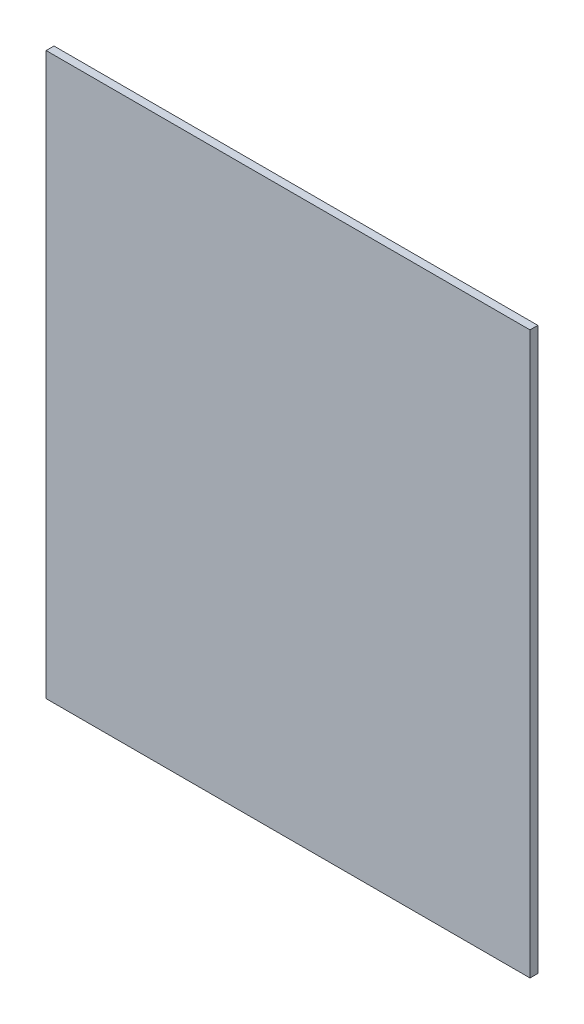
ISO-10303-21;
HEADER;
FILE_DESCRIPTION(('STEP AP214'),'2;1');
FILE_NAME('part.step','',(''),(''),'','','');
FILE_SCHEMA(('AUTOMOTIVE_DESIGN { 1 0 10303 214 1 1 1 1 }'));
ENDSEC;
DATA;
#1=APPLICATION_CONTEXT('core data for automotive mechanical design processes');
#2=APPLICATION_PROTOCOL_DEFINITION('international standard','automotive_design',2000,#1);
#3=PRODUCT_CONTEXT('',#1,'mechanical');
#4=PRODUCT('Part','Part','',(#3));
#5=PRODUCT_RELATED_PRODUCT_CATEGORY('part','',(#4));
#6=PRODUCT_DEFINITION_FORMATION('','',#4);
#7=PRODUCT_DEFINITION_CONTEXT('part definition',#1,'design');
#8=PRODUCT_DEFINITION('design','',#6,#7);
#9=PRODUCT_DEFINITION_SHAPE('','',#8);
#10=(LENGTH_UNIT() NAMED_UNIT(*) SI_UNIT(.MILLI.,.METRE.));
#11=(NAMED_UNIT(*) PLANE_ANGLE_UNIT() SI_UNIT($,.RADIAN.));
#12=(NAMED_UNIT(*) SI_UNIT($,.STERADIAN.) SOLID_ANGLE_UNIT());
#13=UNCERTAINTY_MEASURE_WITH_UNIT(LENGTH_MEASURE(1.E-05),#10,'distance_accuracy_value','');
#14=(GEOMETRIC_REPRESENTATION_CONTEXT(3) GLOBAL_UNCERTAINTY_ASSIGNED_CONTEXT((#13)) GLOBAL_UNIT_ASSIGNED_CONTEXT((#10,
#11,#12)) REPRESENTATION_CONTEXT('',''));
#15=CARTESIAN_POINT('',(0.,0.,0.));
#16=DIRECTION('',(0.,0.,1.));
#17=DIRECTION('',(1.,0.,0.));
#18=AXIS2_PLACEMENT_3D('',#15,#16,#17);
#19=CARTESIAN_POINT('',(-106.071708888458,231.547058823529,4.2));
#20=DIRECTION('',(1.,0.,0.));
#21=DIRECTION('',(0.,1.,0.));
#22=AXIS2_PLACEMENT_3D('',#19,#20,#21);
#23=PLANE('',#22);
#24=DIRECTION('',(0.,-1.,0.));
#25=VECTOR('',#24,1.);
#26=CARTESIAN_POINT('',(-106.071708888458,231.547058823529,0.));
#27=LINE('',#26,#25);
#28=CARTESIAN_POINT('',(-106.071708888458,231.547058823529,0.));
#29=VERTEX_POINT('',#28);
#30=CARTESIAN_POINT('',(-106.071708888458,-68.4529411764705,0.));
#31=VERTEX_POINT('',#30);
#32=EDGE_CURVE('E107',#29,#31,#27,.T.);
#33=ORIENTED_EDGE('',*,*,#32,.T.);
#34=DIRECTION('',(0.,0.,-1.));
#35=VECTOR('',#34,1.);
#36=CARTESIAN_POINT('',(-106.071708888458,-68.4529411764705,4.2));
#37=LINE('',#36,#35);
#38=CARTESIAN_POINT('',(-106.071708888458,-68.4529411764705,4.2));
#39=VERTEX_POINT('',#38);
#40=EDGE_CURVE('E11',#39,#31,#37,.T.);
#41=ORIENTED_EDGE('',*,*,#40,.F.);
#42=DIRECTION('',(0.,-1.,0.));
#43=VECTOR('',#42,1.);
#44=CARTESIAN_POINT('',(-106.071708888458,231.547058823529,4.2));
#45=LINE('',#44,#43);
#46=CARTESIAN_POINT('',(-106.071708888458,231.547058823529,4.2));
#47=VERTEX_POINT('',#46);
#48=EDGE_CURVE('E91',#47,#39,#45,.T.);
#49=ORIENTED_EDGE('',*,*,#48,.F.);
#50=DIRECTION('',(0.,0.,-1.));
#51=VECTOR('',#50,1.);
#52=CARTESIAN_POINT('',(-106.071708888458,231.547058823529,4.2));
#53=LINE('',#52,#51);
#54=EDGE_CURVE('E103',#47,#29,#53,.T.);
#55=ORIENTED_EDGE('',*,*,#54,.T.);
#56=EDGE_LOOP('',(#33,#41,#49,#55));
#57=FACE_BOUND('',#56,.T.);
#58=ADVANCED_FACE('F39',(#57),#23,.F.);
#59=CARTESIAN_POINT('',(-106.071708888458,-68.4529411764705,4.2));
#60=DIRECTION('',(0.,1.,0.));
#61=DIRECTION('',(0.,0.,1.));
#62=AXIS2_PLACEMENT_3D('',#59,#60,#61);
#63=PLANE('',#62);
#64=DIRECTION('',(1.,0.,0.));
#65=VECTOR('',#64,1.);
#66=CARTESIAN_POINT('',(-106.071708888458,-68.4529411764705,0.));
#67=LINE('',#66,#65);
#68=CARTESIAN_POINT('',(152.528291111542,-68.4529411764705,0.));
#69=VERTEX_POINT('',#68);
#70=EDGE_CURVE('E96',#31,#69,#67,.T.);
#71=ORIENTED_EDGE('',*,*,#70,.T.);
#72=DIRECTION('',(0.,0.,-1.));
#73=VECTOR('',#72,1.);
#74=CARTESIAN_POINT('',(152.528291111542,-68.4529411764705,4.2));
#75=LINE('',#74,#73);
#76=CARTESIAN_POINT('',(152.528291111542,-68.4529411764705,4.2));
#77=VERTEX_POINT('',#76);
#78=EDGE_CURVE('E48',#77,#69,#75,.T.);
#79=ORIENTED_EDGE('',*,*,#78,.F.);
#80=DIRECTION('',(1.,0.,0.));
#81=VECTOR('',#80,1.);
#82=CARTESIAN_POINT('',(-106.071708888458,-68.4529411764705,4.2));
#83=LINE('',#82,#81);
#84=EDGE_CURVE('E86',#39,#77,#83,.T.);
#85=ORIENTED_EDGE('',*,*,#84,.F.);
#86=ORIENTED_EDGE('',*,*,#40,.T.);
#87=EDGE_LOOP('',(#71,#79,#85,#86));
#88=FACE_BOUND('',#87,.T.);
#89=ADVANCED_FACE('F95',(#88),#63,.F.);
#90=CARTESIAN_POINT('',(152.528291111542,231.547058823529,4.2));
#91=DIRECTION('',(-1.,0.,0.));
#92=DIRECTION('',(0.,0.,1.));
#93=AXIS2_PLACEMENT_3D('',#90,#91,#92);
#94=PLANE('',#93);
#95=DIRECTION('',(0.,1.,0.));
#96=VECTOR('',#95,1.);
#97=CARTESIAN_POINT('',(152.528291111542,231.547058823529,0.));
#98=LINE('',#97,#96);
#99=CARTESIAN_POINT('',(152.528291111542,231.547058823529,0.));
#100=VERTEX_POINT('',#99);
#101=EDGE_CURVE('E73',#69,#100,#98,.T.);
#102=ORIENTED_EDGE('',*,*,#101,.T.);
#103=DIRECTION('',(0.,0.,-1.));
#104=VECTOR('',#103,1.);
#105=CARTESIAN_POINT('',(152.528291111542,231.547058823529,4.2));
#106=LINE('',#105,#104);
#107=CARTESIAN_POINT('',(152.528291111542,231.547058823529,4.2));
#108=VERTEX_POINT('',#107);
#109=EDGE_CURVE('E98',#108,#100,#106,.T.);
#110=ORIENTED_EDGE('',*,*,#109,.F.);
#111=DIRECTION('',(0.,1.,0.));
#112=VECTOR('',#111,1.);
#113=CARTESIAN_POINT('',(152.528291111542,231.547058823529,4.2));
#114=LINE('',#113,#112);
#115=EDGE_CURVE('E89',#77,#108,#114,.T.);
#116=ORIENTED_EDGE('',*,*,#115,.F.);
#117=ORIENTED_EDGE('',*,*,#78,.T.);
#118=EDGE_LOOP('',(#102,#110,#116,#117));
#119=FACE_BOUND('',#118,.T.);
#120=ADVANCED_FACE('F99',(#119),#94,.F.);
#121=CARTESIAN_POINT('',(-106.071708888458,231.547058823529,4.2));
#122=DIRECTION('',(0.,-1.,0.));
#123=DIRECTION('',(0.,0.,-1.));
#124=AXIS2_PLACEMENT_3D('',#121,#122,#123);
#125=PLANE('',#124);
#126=DIRECTION('',(-1.,0.,0.));
#127=VECTOR('',#126,1.);
#128=CARTESIAN_POINT('',(-106.071708888458,231.547058823529,0.));
#129=LINE('',#128,#127);
#130=EDGE_CURVE('E79',#100,#29,#129,.T.);
#131=ORIENTED_EDGE('',*,*,#130,.T.);
#132=ORIENTED_EDGE('',*,*,#54,.F.);
#133=DIRECTION('',(-1.,0.,0.));
#134=VECTOR('',#133,1.);
#135=CARTESIAN_POINT('',(-106.071708888458,231.547058823529,4.2));
#136=LINE('',#135,#134);
#137=EDGE_CURVE('E56',#108,#47,#136,.T.);
#138=ORIENTED_EDGE('',*,*,#137,.F.);
#139=ORIENTED_EDGE('',*,*,#109,.T.);
#140=EDGE_LOOP('',(#131,#132,#138,#139));
#141=FACE_BOUND('',#140,.T.);
#142=ADVANCED_FACE('F120',(#141),#125,.F.);
#143=CARTESIAN_POINT('',(0.,0.,4.2));
#144=DIRECTION('',(0.,0.,1.));
#145=DIRECTION('',(1.,0.,0.));
#146=AXIS2_PLACEMENT_3D('',#143,#144,#145);
#147=PLANE('',#146);
#148=ORIENTED_EDGE('',*,*,#48,.T.);
#149=ORIENTED_EDGE('',*,*,#84,.T.);
#150=ORIENTED_EDGE('',*,*,#115,.T.);
#151=ORIENTED_EDGE('',*,*,#137,.T.);
#152=EDGE_LOOP('',(#148,#149,#150,#151));
#153=FACE_BOUND('',#152,.T.);
#154=ADVANCED_FACE('F87',(#153),#147,.T.);
#155=CARTESIAN_POINT('',(0.,0.,0.));
#156=DIRECTION('',(0.,0.,1.));
#157=DIRECTION('',(1.,0.,0.));
#158=AXIS2_PLACEMENT_3D('',#155,#156,#157);
#159=PLANE('',#158);
#160=ORIENTED_EDGE('',*,*,#32,.F.);
#161=ORIENTED_EDGE('',*,*,#130,.F.);
#162=ORIENTED_EDGE('',*,*,#101,.F.);
#163=ORIENTED_EDGE('',*,*,#70,.F.);
#164=EDGE_LOOP('',(#160,#161,#162,#163));
#165=FACE_BOUND('',#164,.T.);
#166=ADVANCED_FACE('F123',(#165),#159,.F.);
#167=CLOSED_SHELL('',(#58,#89,#120,#142,#154,#166));
#168=MANIFOLD_SOLID_BREP('B2',#167);
#169=ADVANCED_BREP_SHAPE_REPRESENTATION('',(#18,#168),#14);
#170=SHAPE_DEFINITION_REPRESENTATION(#9,#169);
ENDSEC;
END-ISO-10303-21;
